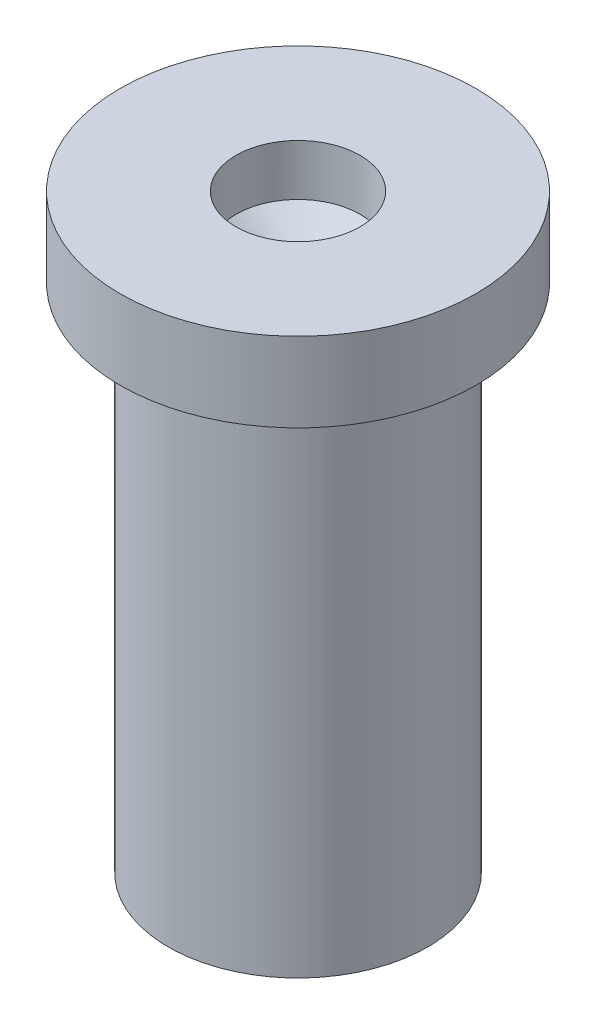
ISO-10303-21;
HEADER;
FILE_DESCRIPTION(('STEP AP214'),'2;1');
FILE_NAME('part.step','',(''),(''),'','','');
FILE_SCHEMA(('AUTOMOTIVE_DESIGN { 1 0 10303 214 1 1 1 1 }'));
ENDSEC;
DATA;
#1=APPLICATION_CONTEXT('core data for automotive mechanical design processes');
#2=APPLICATION_PROTOCOL_DEFINITION('international standard','automotive_design',2000,#1);
#3=PRODUCT_CONTEXT('',#1,'mechanical');
#4=PRODUCT('Part','Part','',(#3));
#5=PRODUCT_RELATED_PRODUCT_CATEGORY('part','',(#4));
#6=PRODUCT_DEFINITION_FORMATION('','',#4);
#7=PRODUCT_DEFINITION_CONTEXT('part definition',#1,'design');
#8=PRODUCT_DEFINITION('design','',#6,#7);
#9=PRODUCT_DEFINITION_SHAPE('','',#8);
#10=(LENGTH_UNIT() NAMED_UNIT(*) SI_UNIT(.MILLI.,.METRE.));
#11=(NAMED_UNIT(*) PLANE_ANGLE_UNIT() SI_UNIT($,.RADIAN.));
#12=(NAMED_UNIT(*) SI_UNIT($,.STERADIAN.) SOLID_ANGLE_UNIT());
#13=UNCERTAINTY_MEASURE_WITH_UNIT(LENGTH_MEASURE(1.E-05),#10,'distance_accuracy_value','');
#14=(GEOMETRIC_REPRESENTATION_CONTEXT(3) GLOBAL_UNCERTAINTY_ASSIGNED_CONTEXT((#13)) GLOBAL_UNIT_ASSIGNED_CONTEXT((#10,
#11,#12)) REPRESENTATION_CONTEXT('',''));
#15=CARTESIAN_POINT('',(0.,0.,0.));
#16=DIRECTION('',(0.,0.,1.));
#17=DIRECTION('',(1.,0.,0.));
#18=AXIS2_PLACEMENT_3D('',#15,#16,#17);
#19=CARTESIAN_POINT('',(0.,0.,0.));
#20=DIRECTION('',(0.,-1.,0.));
#21=DIRECTION('',(0.,0.,-1.));
#22=AXIS2_PLACEMENT_3D('',#19,#20,#21);
#23=PLANE('',#22);
#24=CARTESIAN_POINT('',(0.,0.,0.));
#25=DIRECTION('',(0.,-1.,0.));
#26=DIRECTION('',(0.,0.,-1.));
#27=AXIS2_PLACEMENT_3D('',#24,#25,#26);
#28=CIRCLE('',#27,3.1);
#29=CARTESIAN_POINT('',(0.,0.,-3.1));
#30=VERTEX_POINT('',#29);
#31=EDGE_CURVE('E11',#30,#30,#28,.T.);
#32=ORIENTED_EDGE('',*,*,#31,.T.);
#33=EDGE_LOOP('',(#32));
#34=FACE_BOUND('',#33,.T.);
#35=ADVANCED_FACE('F41',(#34),#23,.T.);
#36=CARTESIAN_POINT('',(0.,0.,0.));
#37=DIRECTION('',(0.,-1.,0.));
#38=DIRECTION('',(0.,0.,-1.));
#39=AXIS2_PLACEMENT_3D('',#36,#37,#38);
#40=CYLINDRICAL_SURFACE('',#39,3.1);
#41=CARTESIAN_POINT('',(0.,12.2,0.));
#42=DIRECTION('',(0.,-1.,0.));
#43=DIRECTION('',(0.,0.,-1.));
#44=AXIS2_PLACEMENT_3D('',#41,#42,#43);
#45=CIRCLE('',#44,3.1);
#46=CARTESIAN_POINT('',(0.,12.2,-3.1));
#47=VERTEX_POINT('',#46);
#48=EDGE_CURVE('E48',#47,#47,#45,.T.);
#49=ORIENTED_EDGE('',*,*,#48,.T.);
#50=EDGE_LOOP('',(#49));
#51=FACE_BOUND('',#50,.T.);
#52=ORIENTED_EDGE('',*,*,#31,.F.);
#53=EDGE_LOOP('',(#52));
#54=FACE_BOUND('',#53,.T.);
#55=ADVANCED_FACE('F78',(#51,#54),#40,.T.);
#56=CARTESIAN_POINT('',(3.1,12.2,0.));
#57=DIRECTION('',(0.,-1.,0.));
#58=DIRECTION('',(0.,0.,-1.));
#59=AXIS2_PLACEMENT_3D('',#56,#57,#58);
#60=PLANE('',#59);
#61=CARTESIAN_POINT('',(0.,12.2,0.));
#62=DIRECTION('',(0.,-1.,0.));
#63=DIRECTION('',(0.,0.,-1.));
#64=AXIS2_PLACEMENT_3D('',#61,#62,#63);
#65=CIRCLE('',#64,4.25035850908749);
#66=CARTESIAN_POINT('',(0.,12.2,-4.25035850908749));
#67=VERTEX_POINT('',#66);
#68=EDGE_CURVE('E71',#67,#67,#65,.T.);
#69=ORIENTED_EDGE('',*,*,#68,.T.);
#70=EDGE_LOOP('',(#69));
#71=FACE_BOUND('',#70,.T.);
#72=ORIENTED_EDGE('',*,*,#48,.F.);
#73=EDGE_LOOP('',(#72));
#74=FACE_BOUND('',#73,.T.);
#75=ADVANCED_FACE('F81',(#71,#74),#60,.T.);
#76=CARTESIAN_POINT('',(0.,0.,0.));
#77=DIRECTION('',(0.,-1.,0.));
#78=DIRECTION('',(0.,0.,-1.));
#79=AXIS2_PLACEMENT_3D('',#76,#77,#78);
#80=CYLINDRICAL_SURFACE('',#79,4.25035850908749);
#81=CARTESIAN_POINT('',(0.,14.0963207571628,0.));
#82=DIRECTION('',(0.,-1.,0.));
#83=DIRECTION('',(0.,0.,-1.));
#84=AXIS2_PLACEMENT_3D('',#81,#82,#83);
#85=CIRCLE('',#84,4.25035850908749);
#86=CARTESIAN_POINT('',(0.,14.0963207571628,-4.25035850908749));
#87=VERTEX_POINT('',#86);
#88=EDGE_CURVE('E65',#87,#87,#85,.T.);
#89=ORIENTED_EDGE('',*,*,#88,.T.);
#90=EDGE_LOOP('',(#89));
#91=FACE_BOUND('',#90,.T.);
#92=ORIENTED_EDGE('',*,*,#68,.F.);
#93=EDGE_LOOP('',(#92));
#94=FACE_BOUND('',#93,.T.);
#95=ADVANCED_FACE('F83',(#91,#94),#80,.T.);
#96=CARTESIAN_POINT('',(4.25035850908749,14.0963207571628,0.));
#97=DIRECTION('',(0.,1.,0.));
#98=DIRECTION('',(0.,0.,1.));
#99=AXIS2_PLACEMENT_3D('',#96,#97,#98);
#100=PLANE('',#99);
#101=CARTESIAN_POINT('',(0.,14.0963207571628,0.));
#102=DIRECTION('',(0.,-1.,0.));
#103=DIRECTION('',(0.,0.,-1.));
#104=AXIS2_PLACEMENT_3D('',#101,#102,#103);
#105=CIRCLE('',#104,1.48252595060616);
#106=CARTESIAN_POINT('',(0.,14.0963207571628,-1.48252595060616));
#107=VERTEX_POINT('',#106);
#108=EDGE_CURVE('E61',#107,#107,#105,.T.);
#109=ORIENTED_EDGE('',*,*,#108,.T.);
#110=EDGE_LOOP('',(#109));
#111=FACE_BOUND('',#110,.T.);
#112=ORIENTED_EDGE('',*,*,#88,.F.);
#113=EDGE_LOOP('',(#112));
#114=FACE_BOUND('',#113,.T.);
#115=ADVANCED_FACE('F90',(#111,#114),#100,.T.);
#116=CARTESIAN_POINT('',(0.,0.,0.));
#117=DIRECTION('',(0.,-1.,0.));
#118=DIRECTION('',(0.,0.,-1.));
#119=AXIS2_PLACEMENT_3D('',#116,#117,#118);
#120=CYLINDRICAL_SURFACE('',#119,1.48252595060616);
#121=CARTESIAN_POINT('',(0.,12.8752181578328,0.));
#122=DIRECTION('',(0.,-1.,0.));
#123=DIRECTION('',(0.,0.,-1.));
#124=AXIS2_PLACEMENT_3D('',#121,#122,#123);
#125=CIRCLE('',#124,1.48252595060616);
#126=CARTESIAN_POINT('',(0.,12.8752181578328,-1.48252595060616));
#127=VERTEX_POINT('',#126);
#128=EDGE_CURVE('E58',#127,#127,#125,.T.);
#129=ORIENTED_EDGE('',*,*,#128,.T.);
#130=EDGE_LOOP('',(#129));
#131=FACE_BOUND('',#130,.T.);
#132=ORIENTED_EDGE('',*,*,#108,.F.);
#133=EDGE_LOOP('',(#132));
#134=FACE_BOUND('',#133,.T.);
#135=ADVANCED_FACE('F54',(#131,#134),#120,.F.);
#136=CARTESIAN_POINT('',(0.,12.8752181578328,0.));
#137=DIRECTION('',(0.,1.,0.));
#138=DIRECTION('',(0.,0.,1.));
#139=AXIS2_PLACEMENT_3D('',#136,#137,#138);
#140=CONICAL_SURFACE('',#139,1.48252595060616,0.978442517661027);
#141=CARTESIAN_POINT('',(0.,11.8775225708468,0.));
#142=VERTEX_POINT('',#141);
#143=VERTEX_LOOP('',#142);
#144=FACE_BOUND('',#143,.T.);
#145=ORIENTED_EDGE('',*,*,#128,.F.);
#146=EDGE_LOOP('',(#145));
#147=FACE_BOUND('',#146,.T.);
#148=ADVANCED_FACE('F51',(#144,#147),#140,.F.);
#149=CLOSED_SHELL('',(#35,#55,#75,#95,#115,#135,#148));
#150=MANIFOLD_SOLID_BREP('B2',#149);
#151=ADVANCED_BREP_SHAPE_REPRESENTATION('',(#18,#150),#14);
#152=SHAPE_DEFINITION_REPRESENTATION(#9,#151);
ENDSEC;
END-ISO-10303-21;
